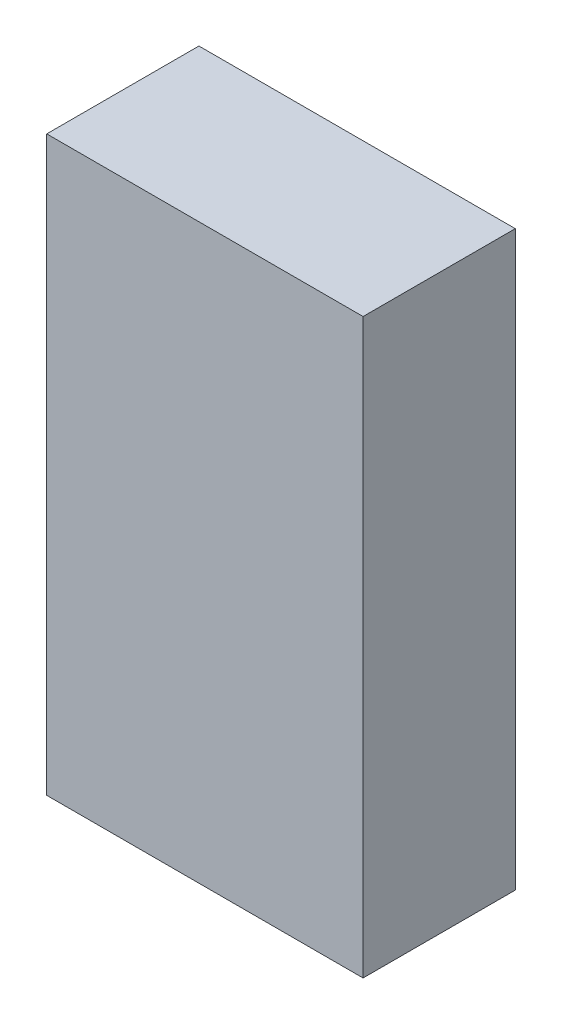
ISO-10303-21;
HEADER;
FILE_DESCRIPTION(('STEP AP214'),'2;1');
FILE_NAME('part.step','',(''),(''),'','','');
FILE_SCHEMA(('AUTOMOTIVE_DESIGN { 1 0 10303 214 1 1 1 1 }'));
ENDSEC;
DATA;
#1=APPLICATION_CONTEXT('core data for automotive mechanical design processes');
#2=APPLICATION_PROTOCOL_DEFINITION('international standard','automotive_design',2000,#1);
#3=PRODUCT_CONTEXT('',#1,'mechanical');
#4=PRODUCT('Part','Part','',(#3));
#5=PRODUCT_RELATED_PRODUCT_CATEGORY('part','',(#4));
#6=PRODUCT_DEFINITION_FORMATION('','',#4);
#7=PRODUCT_DEFINITION_CONTEXT('part definition',#1,'design');
#8=PRODUCT_DEFINITION('design','',#6,#7);
#9=PRODUCT_DEFINITION_SHAPE('','',#8);
#10=(LENGTH_UNIT() NAMED_UNIT(*) SI_UNIT(.MILLI.,.METRE.));
#11=(NAMED_UNIT(*) PLANE_ANGLE_UNIT() SI_UNIT($,.RADIAN.));
#12=(NAMED_UNIT(*) SI_UNIT($,.STERADIAN.) SOLID_ANGLE_UNIT());
#13=UNCERTAINTY_MEASURE_WITH_UNIT(LENGTH_MEASURE(1.E-05),#10,'distance_accuracy_value','');
#14=(GEOMETRIC_REPRESENTATION_CONTEXT(3) GLOBAL_UNCERTAINTY_ASSIGNED_CONTEXT((#13)) GLOBAL_UNIT_ASSIGNED_CONTEXT((#10,
#11,#12)) REPRESENTATION_CONTEXT('',''));
#15=CARTESIAN_POINT('',(0.,0.,0.));
#16=DIRECTION('',(0.,0.,1.));
#17=DIRECTION('',(1.,0.,0.));
#18=AXIS2_PLACEMENT_3D('',#15,#16,#17);
#19=CARTESIAN_POINT('',(-1.84999884,3.35000092,0.01999996));
#20=DIRECTION('',(1.,0.,0.));
#21=DIRECTION('',(0.,-1.,0.));
#22=AXIS2_PLACEMENT_3D('',#19,#20,#21);
#23=PLANE('',#22);
#24=DIRECTION('',(0.,-1.,0.));
#25=VECTOR('',#24,1.);
#26=CARTESIAN_POINT('',(-1.84999884,3.35000092,0.01999996));
#27=LINE('',#26,#25);
#28=CARTESIAN_POINT('',(-1.84999884,3.35000092,0.01999996));
#29=VERTEX_POINT('',#28);
#30=CARTESIAN_POINT('',(-1.84999884,-3.34999838,0.01999996));
#31=VERTEX_POINT('',#30);
#32=EDGE_CURVE('E9',#29,#31,#27,.T.);
#33=ORIENTED_EDGE('',*,*,#32,.T.);
#34=DIRECTION('',(0.,0.,1.));
#35=VECTOR('',#34,1.);
#36=CARTESIAN_POINT('',(-1.84999884,-3.34999838,0.01999996));
#37=LINE('',#36,#35);
#38=CARTESIAN_POINT('',(-1.84999884,-3.34999838,1.79999894));
#39=VERTEX_POINT('',#38);
#40=EDGE_CURVE('E22',#31,#39,#37,.T.);
#41=ORIENTED_EDGE('',*,*,#40,.T.);
#42=DIRECTION('',(0.,-1.,0.));
#43=VECTOR('',#42,1.);
#44=CARTESIAN_POINT('',(-1.84999884,3.35000092,1.79999894));
#45=LINE('',#44,#43);
#46=CARTESIAN_POINT('',(-1.84999884,3.35000092,1.79999894));
#47=VERTEX_POINT('',#46);
#48=EDGE_CURVE('E84',#47,#39,#45,.T.);
#49=ORIENTED_EDGE('',*,*,#48,.F.);
#50=DIRECTION('',(0.,0.,1.));
#51=VECTOR('',#50,1.);
#52=CARTESIAN_POINT('',(-1.84999884,3.35000092,0.01999996));
#53=LINE('',#52,#51);
#54=EDGE_CURVE('E32',#29,#47,#53,.T.);
#55=ORIENTED_EDGE('',*,*,#54,.F.);
#56=EDGE_LOOP('',(#33,#41,#49,#55));
#57=FACE_BOUND('',#56,.T.);
#58=ADVANCED_FACE('F15',(#57),#23,.F.);
#59=CARTESIAN_POINT('',(-1.84999884,-3.34999838,0.01999996));
#60=DIRECTION('',(0.,1.,0.));
#61=DIRECTION('',(1.,0.,0.));
#62=AXIS2_PLACEMENT_3D('',#59,#60,#61);
#63=PLANE('',#62);
#64=DIRECTION('',(1.,0.,0.));
#65=VECTOR('',#64,1.);
#66=CARTESIAN_POINT('',(-1.84999884,-3.34999838,0.01999996));
#67=LINE('',#66,#65);
#68=CARTESIAN_POINT('',(1.85000138,-3.34999838,0.01999996));
#69=VERTEX_POINT('',#68);
#70=EDGE_CURVE('E81',#31,#69,#67,.T.);
#71=ORIENTED_EDGE('',*,*,#70,.T.);
#72=DIRECTION('',(0.,0.,1.));
#73=VECTOR('',#72,1.);
#74=CARTESIAN_POINT('',(1.85000138,-3.34999838,0.01999996));
#75=LINE('',#74,#73);
#76=CARTESIAN_POINT('',(1.85000138,-3.34999838,1.79999894));
#77=VERTEX_POINT('',#76);
#78=EDGE_CURVE('E79',#69,#77,#75,.T.);
#79=ORIENTED_EDGE('',*,*,#78,.T.);
#80=DIRECTION('',(1.,0.,0.));
#81=VECTOR('',#80,1.);
#82=CARTESIAN_POINT('',(-1.84999884,-3.34999838,1.79999894));
#83=LINE('',#82,#81);
#84=EDGE_CURVE('E57',#39,#77,#83,.T.);
#85=ORIENTED_EDGE('',*,*,#84,.F.);
#86=ORIENTED_EDGE('',*,*,#40,.F.);
#87=EDGE_LOOP('',(#71,#79,#85,#86));
#88=FACE_BOUND('',#87,.T.);
#89=ADVANCED_FACE('F87',(#88),#63,.F.);
#90=CARTESIAN_POINT('',(1.85000138,-3.34999838,0.01999996));
#91=DIRECTION('',(-1.,0.,0.));
#92=DIRECTION('',(0.,1.,0.));
#93=AXIS2_PLACEMENT_3D('',#90,#91,#92);
#94=PLANE('',#93);
#95=DIRECTION('',(0.,1.,0.));
#96=VECTOR('',#95,1.);
#97=CARTESIAN_POINT('',(1.85000138,-3.34999838,0.01999996));
#98=LINE('',#97,#96);
#99=CARTESIAN_POINT('',(1.85000138,3.35000092,0.01999996));
#100=VERTEX_POINT('',#99);
#101=EDGE_CURVE('E73',#69,#100,#98,.T.);
#102=ORIENTED_EDGE('',*,*,#101,.T.);
#103=DIRECTION('',(0.,0.,1.));
#104=VECTOR('',#103,1.);
#105=CARTESIAN_POINT('',(1.85000138,3.35000092,0.01999996));
#106=LINE('',#105,#104);
#107=CARTESIAN_POINT('',(1.85000138,3.35000092,1.79999894));
#108=VERTEX_POINT('',#107);
#109=EDGE_CURVE('E62',#100,#108,#106,.T.);
#110=ORIENTED_EDGE('',*,*,#109,.T.);
#111=DIRECTION('',(0.,1.,0.));
#112=VECTOR('',#111,1.);
#113=CARTESIAN_POINT('',(1.85000138,-3.34999838,1.79999894));
#114=LINE('',#113,#112);
#115=EDGE_CURVE('E52',#77,#108,#114,.T.);
#116=ORIENTED_EDGE('',*,*,#115,.F.);
#117=ORIENTED_EDGE('',*,*,#78,.F.);
#118=EDGE_LOOP('',(#102,#110,#116,#117));
#119=FACE_BOUND('',#118,.T.);
#120=ADVANCED_FACE('F71',(#119),#94,.F.);
#121=CARTESIAN_POINT('',(1.85000138,3.35000092,0.01999996));
#122=DIRECTION('',(0.,-1.,0.));
#123=DIRECTION('',(-1.,0.,0.));
#124=AXIS2_PLACEMENT_3D('',#121,#122,#123);
#125=PLANE('',#124);
#126=DIRECTION('',(-1.,0.,0.));
#127=VECTOR('',#126,1.);
#128=CARTESIAN_POINT('',(1.85000138,3.35000092,0.01999996));
#129=LINE('',#128,#127);
#130=EDGE_CURVE('E63',#100,#29,#129,.T.);
#131=ORIENTED_EDGE('',*,*,#130,.T.);
#132=ORIENTED_EDGE('',*,*,#54,.T.);
#133=DIRECTION('',(-1.,0.,0.));
#134=VECTOR('',#133,1.);
#135=CARTESIAN_POINT('',(1.85000138,3.35000092,1.79999894));
#136=LINE('',#135,#134);
#137=EDGE_CURVE('E55',#108,#47,#136,.T.);
#138=ORIENTED_EDGE('',*,*,#137,.F.);
#139=ORIENTED_EDGE('',*,*,#109,.F.);
#140=EDGE_LOOP('',(#131,#132,#138,#139));
#141=FACE_BOUND('',#140,.T.);
#142=ADVANCED_FACE('F68',(#141),#125,.F.);
#143=CARTESIAN_POINT('',(1.269999984224E-06,1.269999998272E-06,0.01999996));
#144=DIRECTION('',(0.,0.,1.));
#145=DIRECTION('',(1.,0.,0.));
#146=AXIS2_PLACEMENT_3D('',#143,#144,#145);
#147=PLANE('',#146);
#148=ORIENTED_EDGE('',*,*,#130,.F.);
#149=ORIENTED_EDGE('',*,*,#101,.F.);
#150=ORIENTED_EDGE('',*,*,#70,.F.);
#151=ORIENTED_EDGE('',*,*,#32,.F.);
#152=EDGE_LOOP('',(#148,#149,#150,#151));
#153=FACE_BOUND('',#152,.T.);
#154=ADVANCED_FACE('F89',(#153),#147,.F.);
#155=CARTESIAN_POINT('',(1.269999984224E-06,1.269999998272E-06,1.79999894));
#156=DIRECTION('',(0.,0.,1.));
#157=DIRECTION('',(1.,0.,0.));
#158=AXIS2_PLACEMENT_3D('',#155,#156,#157);
#159=PLANE('',#158);
#160=ORIENTED_EDGE('',*,*,#48,.T.);
#161=ORIENTED_EDGE('',*,*,#84,.T.);
#162=ORIENTED_EDGE('',*,*,#115,.T.);
#163=ORIENTED_EDGE('',*,*,#137,.T.);
#164=EDGE_LOOP('',(#160,#161,#162,#163));
#165=FACE_BOUND('',#164,.T.);
#166=ADVANCED_FACE('F54',(#165),#159,.T.);
#167=CLOSED_SHELL('',(#58,#89,#120,#142,#154,#166));
#168=MANIFOLD_SOLID_BREP('B1',#167);
#169=ADVANCED_BREP_SHAPE_REPRESENTATION('',(#18,#168),#14);
#170=SHAPE_DEFINITION_REPRESENTATION(#9,#169);
ENDSEC;
END-ISO-10303-21;
